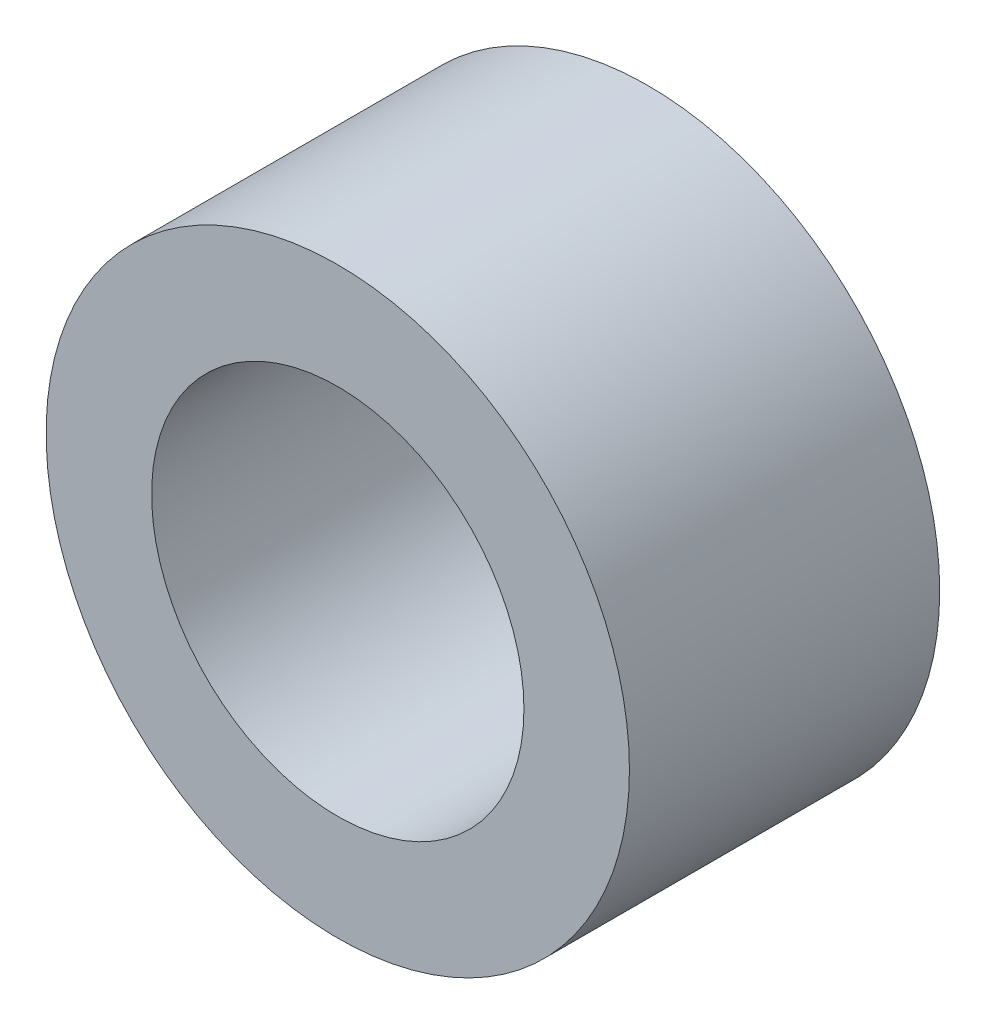
ISO-10303-21;
HEADER;
FILE_DESCRIPTION(('STEP AP214'),'2;1');
FILE_NAME('part.step','',(''),(''),'','','');
FILE_SCHEMA(('AUTOMOTIVE_DESIGN { 1 0 10303 214 1 1 1 1 }'));
ENDSEC;
DATA;
#1=APPLICATION_CONTEXT('core data for automotive mechanical design processes');
#2=APPLICATION_PROTOCOL_DEFINITION('international standard','automotive_design',2000,#1);
#3=PRODUCT_CONTEXT('',#1,'mechanical');
#4=PRODUCT('Part','Part','',(#3));
#5=PRODUCT_RELATED_PRODUCT_CATEGORY('part','',(#4));
#6=PRODUCT_DEFINITION_FORMATION('','',#4);
#7=PRODUCT_DEFINITION_CONTEXT('part definition',#1,'design');
#8=PRODUCT_DEFINITION('design','',#6,#7);
#9=PRODUCT_DEFINITION_SHAPE('','',#8);
#10=(LENGTH_UNIT() NAMED_UNIT(*) SI_UNIT(.MILLI.,.METRE.));
#11=(NAMED_UNIT(*) PLANE_ANGLE_UNIT() SI_UNIT($,.RADIAN.));
#12=(NAMED_UNIT(*) SI_UNIT($,.STERADIAN.) SOLID_ANGLE_UNIT());
#13=UNCERTAINTY_MEASURE_WITH_UNIT(LENGTH_MEASURE(1.E-05),#10,'distance_accuracy_value','');
#14=(GEOMETRIC_REPRESENTATION_CONTEXT(3) GLOBAL_UNCERTAINTY_ASSIGNED_CONTEXT((#13)) GLOBAL_UNIT_ASSIGNED_CONTEXT((#10,
#11,#12)) REPRESENTATION_CONTEXT('',''));
#15=CARTESIAN_POINT('',(0.,0.,0.));
#16=DIRECTION('',(0.,0.,1.));
#17=DIRECTION('',(1.,0.,0.));
#18=AXIS2_PLACEMENT_3D('',#15,#16,#17);
#19=CARTESIAN_POINT('',(0.,0.,0.));
#20=DIRECTION('',(0.,0.,1.));
#21=DIRECTION('',(1.,0.,0.));
#22=AXIS2_PLACEMENT_3D('',#19,#20,#21);
#23=PLANE('',#22);
#24=CARTESIAN_POINT('',(0.,0.,0.));
#25=DIRECTION('',(0.,0.,1.));
#26=DIRECTION('',(1.,0.,0.));
#27=AXIS2_PLACEMENT_3D('',#24,#25,#26);
#28=CIRCLE('',#27,4.7);
#29=CARTESIAN_POINT('',(4.7,0.,0.));
#30=VERTEX_POINT('',#29);
#31=EDGE_CURVE('E34',#30,#30,#28,.T.);
#32=ORIENTED_EDGE('',*,*,#31,.F.);
#33=EDGE_LOOP('',(#32));
#34=FACE_BOUND('',#33,.T.);
#35=CARTESIAN_POINT('',(0.,0.,0.));
#36=DIRECTION('',(0.,0.,1.));
#37=DIRECTION('',(1.,0.,0.));
#38=AXIS2_PLACEMENT_3D('',#35,#36,#37);
#39=CIRCLE('',#38,3.);
#40=CARTESIAN_POINT('',(3.,0.,0.));
#41=VERTEX_POINT('',#40);
#42=EDGE_CURVE('E42',#41,#41,#39,.T.);
#43=ORIENTED_EDGE('',*,*,#42,.T.);
#44=EDGE_LOOP('',(#43));
#45=FACE_BOUND('',#44,.T.);
#46=ADVANCED_FACE('F27',(#34,#45),#23,.F.);
#47=CARTESIAN_POINT('',(0.,0.,5.));
#48=DIRECTION('',(0.,0.,1.));
#49=DIRECTION('',(1.,0.,0.));
#50=AXIS2_PLACEMENT_3D('',#47,#48,#49);
#51=PLANE('',#50);
#52=CARTESIAN_POINT('',(0.,0.,5.));
#53=DIRECTION('',(0.,0.,1.));
#54=DIRECTION('',(1.,0.,0.));
#55=AXIS2_PLACEMENT_3D('',#52,#53,#54);
#56=CIRCLE('',#55,4.7);
#57=CARTESIAN_POINT('',(4.7,0.,5.));
#58=VERTEX_POINT('',#57);
#59=EDGE_CURVE('E10',#58,#58,#56,.T.);
#60=ORIENTED_EDGE('',*,*,#59,.T.);
#61=EDGE_LOOP('',(#60));
#62=FACE_BOUND('',#61,.T.);
#63=CARTESIAN_POINT('',(0.,0.,5.));
#64=DIRECTION('',(0.,0.,1.));
#65=DIRECTION('',(1.,0.,0.));
#66=AXIS2_PLACEMENT_3D('',#63,#64,#65);
#67=CIRCLE('',#66,3.);
#68=CARTESIAN_POINT('',(3.,0.,5.));
#69=VERTEX_POINT('',#68);
#70=EDGE_CURVE('E38',#69,#69,#67,.T.);
#71=ORIENTED_EDGE('',*,*,#70,.F.);
#72=EDGE_LOOP('',(#71));
#73=FACE_BOUND('',#72,.T.);
#74=ADVANCED_FACE('F56',(#62,#73),#51,.T.);
#75=CARTESIAN_POINT('',(0.,0.,5.));
#76=DIRECTION('',(0.,0.,-1.));
#77=DIRECTION('',(-1.,0.,0.));
#78=AXIS2_PLACEMENT_3D('',#75,#76,#77);
#79=CYLINDRICAL_SURFACE('',#78,4.7);
#80=ORIENTED_EDGE('',*,*,#59,.F.);
#81=EDGE_LOOP('',(#80));
#82=FACE_BOUND('',#81,.T.);
#83=ORIENTED_EDGE('',*,*,#31,.T.);
#84=EDGE_LOOP('',(#83));
#85=FACE_BOUND('',#84,.T.);
#86=ADVANCED_FACE('F29',(#82,#85),#79,.T.);
#87=CARTESIAN_POINT('',(0.,0.,5.));
#88=DIRECTION('',(0.,0.,-1.));
#89=DIRECTION('',(-1.,0.,0.));
#90=AXIS2_PLACEMENT_3D('',#87,#88,#89);
#91=CYLINDRICAL_SURFACE('',#90,3.);
#92=ORIENTED_EDGE('',*,*,#70,.T.);
#93=EDGE_LOOP('',(#92));
#94=FACE_BOUND('',#93,.T.);
#95=ORIENTED_EDGE('',*,*,#42,.F.);
#96=EDGE_LOOP('',(#95));
#97=FACE_BOUND('',#96,.T.);
#98=ADVANCED_FACE('F49',(#94,#97),#91,.F.);
#99=CLOSED_SHELL('',(#46,#74,#86,#98));
#100=MANIFOLD_SOLID_BREP('B2',#99);
#101=ADVANCED_BREP_SHAPE_REPRESENTATION('',(#18,#100),#14);
#102=SHAPE_DEFINITION_REPRESENTATION(#9,#101);
ENDSEC;
END-ISO-10303-21;
